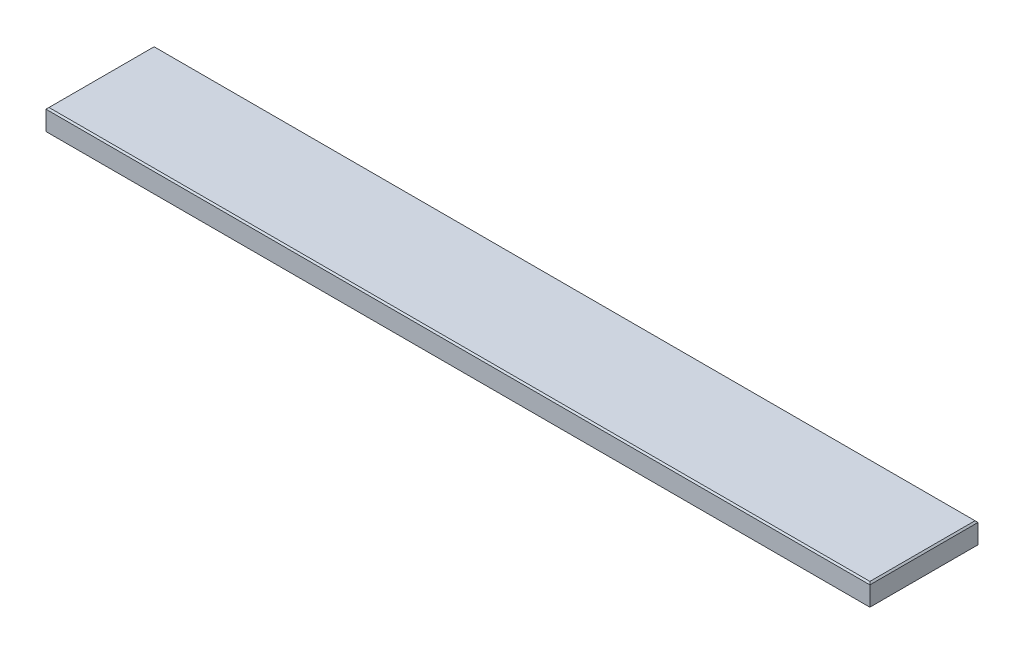
ISO-10303-21;
HEADER;
FILE_DESCRIPTION(('STEP AP214'),'2;1');
FILE_NAME('part.step','',(''),(''),'','','');
FILE_SCHEMA(('AUTOMOTIVE_DESIGN { 1 0 10303 214 1 1 1 1 }'));
ENDSEC;
DATA;
#1=APPLICATION_CONTEXT('core data for automotive mechanical design processes');
#2=APPLICATION_PROTOCOL_DEFINITION('international standard','automotive_design',2000,#1);
#3=PRODUCT_CONTEXT('',#1,'mechanical');
#4=PRODUCT('Part','Part','',(#3));
#5=PRODUCT_RELATED_PRODUCT_CATEGORY('part','',(#4));
#6=PRODUCT_DEFINITION_FORMATION('','',#4);
#7=PRODUCT_DEFINITION_CONTEXT('part definition',#1,'design');
#8=PRODUCT_DEFINITION('design','',#6,#7);
#9=PRODUCT_DEFINITION_SHAPE('','',#8);
#10=(LENGTH_UNIT() NAMED_UNIT(*) SI_UNIT(.MILLI.,.METRE.));
#11=(NAMED_UNIT(*) PLANE_ANGLE_UNIT() SI_UNIT($,.RADIAN.));
#12=(NAMED_UNIT(*) SI_UNIT($,.STERADIAN.) SOLID_ANGLE_UNIT());
#13=UNCERTAINTY_MEASURE_WITH_UNIT(LENGTH_MEASURE(1.E-05),#10,'distance_accuracy_value','');
#14=(GEOMETRIC_REPRESENTATION_CONTEXT(3) GLOBAL_UNCERTAINTY_ASSIGNED_CONTEXT((#13)) GLOBAL_UNIT_ASSIGNED_CONTEXT((#10,
#11,#12)) REPRESENTATION_CONTEXT('',''));
#15=CARTESIAN_POINT('',(0.,0.,0.));
#16=DIRECTION('',(0.,0.,1.));
#17=DIRECTION('',(1.,0.,0.));
#18=AXIS2_PLACEMENT_3D('',#15,#16,#17);
#19=CARTESIAN_POINT('',(1403.35,38.1,0.));
#20=DIRECTION('',(-1.,0.,0.));
#21=DIRECTION('',(0.,0.,1.));
#22=AXIS2_PLACEMENT_3D('',#19,#20,#21);
#23=PLANE('',#22);
#24=DIRECTION('',(0.,-1.,0.));
#25=VECTOR('',#24,1.);
#26=CARTESIAN_POINT('',(1403.35,38.1,-184.15));
#27=LINE('',#26,#25);
#28=CARTESIAN_POINT('',(1403.35,35.56,-184.15));
#29=VERTEX_POINT('',#28);
#30=CARTESIAN_POINT('',(1403.35,2.53999999999978,-184.15));
#31=VERTEX_POINT('',#30);
#32=EDGE_CURVE('E127',#29,#31,#27,.T.);
#33=ORIENTED_EDGE('',*,*,#32,.F.);
#34=DIRECTION('',(0.,0.,1.));
#35=VECTOR('',#34,1.);
#36=CARTESIAN_POINT('',(1403.35,35.56,0.));
#37=LINE('',#36,#35);
#38=CARTESIAN_POINT('',(1403.35,35.56,0.));
#39=VERTEX_POINT('',#38);
#40=EDGE_CURVE('E151',#29,#39,#37,.T.);
#41=ORIENTED_EDGE('',*,*,#40,.T.);
#42=DIRECTION('',(0.,-1.,0.));
#43=VECTOR('',#42,1.);
#44=CARTESIAN_POINT('',(1403.35,38.1,0.));
#45=LINE('',#44,#43);
#46=CARTESIAN_POINT('',(1403.35,2.53999999999978,0.));
#47=VERTEX_POINT('',#46);
#48=EDGE_CURVE('E162',#39,#47,#45,.T.);
#49=ORIENTED_EDGE('',*,*,#48,.T.);
#50=DIRECTION('',(0.,0.,-1.));
#51=VECTOR('',#50,1.);
#52=CARTESIAN_POINT('',(1403.35,2.53999999999976,-184.15));
#53=LINE('',#52,#51);
#54=EDGE_CURVE('E149',#47,#31,#53,.T.);
#55=ORIENTED_EDGE('',*,*,#54,.T.);
#56=EDGE_LOOP('',(#33,#41,#49,#55));
#57=FACE_BOUND('',#56,.T.);
#58=ADVANCED_FACE('F41',(#57),#23,.F.);
#59=CARTESIAN_POINT('',(0.,38.1,-184.15));
#60=DIRECTION('',(0.,0.,1.));
#61=DIRECTION('',(1.,0.,0.));
#62=AXIS2_PLACEMENT_3D('',#59,#60,#61);
#63=PLANE('',#62);
#64=DIRECTION('',(0.,-1.,0.));
#65=VECTOR('',#64,1.);
#66=CARTESIAN_POINT('',(0.,38.1,-184.15));
#67=LINE('',#66,#65);
#68=CARTESIAN_POINT('',(0.,35.56,-184.15));
#69=VERTEX_POINT('',#68);
#70=CARTESIAN_POINT('',(0.,2.53999999999978,-184.15));
#71=VERTEX_POINT('',#70);
#72=EDGE_CURVE('E314',#69,#71,#67,.T.);
#73=ORIENTED_EDGE('',*,*,#72,.F.);
#74=DIRECTION('',(1.,0.,0.));
#75=VECTOR('',#74,1.);
#76=CARTESIAN_POINT('',(0.,35.56,-184.15));
#77=LINE('',#76,#75);
#78=EDGE_CURVE('E147',#69,#29,#77,.T.);
#79=ORIENTED_EDGE('',*,*,#78,.T.);
#80=ORIENTED_EDGE('',*,*,#32,.T.);
#81=DIRECTION('',(-1.,0.,0.));
#82=VECTOR('',#81,1.);
#83=CARTESIAN_POINT('',(0.,2.53999999999976,-184.15));
#84=LINE('',#83,#82);
#85=EDGE_CURVE('E144',#31,#71,#84,.T.);
#86=ORIENTED_EDGE('',*,*,#85,.T.);
#87=EDGE_LOOP('',(#73,#79,#80,#86));
#88=FACE_BOUND('',#87,.T.);
#89=ADVANCED_FACE('F199',(#88),#63,.F.);
#90=CARTESIAN_POINT('',(0.,38.1,0.));
#91=DIRECTION('',(1.,0.,0.));
#92=DIRECTION('',(0.,0.,-1.));
#93=AXIS2_PLACEMENT_3D('',#90,#91,#92);
#94=PLANE('',#93);
#95=DIRECTION('',(0.,-1.,0.));
#96=VECTOR('',#95,1.);
#97=CARTESIAN_POINT('',(0.,38.1,0.));
#98=LINE('',#97,#96);
#99=CARTESIAN_POINT('',(0.,35.56,0.));
#100=VERTEX_POINT('',#99);
#101=CARTESIAN_POINT('',(0.,2.53999999999978,0.));
#102=VERTEX_POINT('',#101);
#103=EDGE_CURVE('E310',#100,#102,#98,.T.);
#104=ORIENTED_EDGE('',*,*,#103,.F.);
#105=DIRECTION('',(0.,0.,-1.));
#106=VECTOR('',#105,1.);
#107=CARTESIAN_POINT('',(0.,35.56,0.));
#108=LINE('',#107,#106);
#109=EDGE_CURVE('E142',#100,#69,#108,.T.);
#110=ORIENTED_EDGE('',*,*,#109,.T.);
#111=ORIENTED_EDGE('',*,*,#72,.T.);
#112=DIRECTION('',(0.,0.,1.));
#113=VECTOR('',#112,1.);
#114=CARTESIAN_POINT('',(0.,2.53999999999976,0.));
#115=LINE('',#114,#113);
#116=EDGE_CURVE('E140',#71,#102,#115,.T.);
#117=ORIENTED_EDGE('',*,*,#116,.T.);
#118=EDGE_LOOP('',(#104,#110,#111,#117));
#119=FACE_BOUND('',#118,.T.);
#120=ADVANCED_FACE('F205',(#119),#94,.F.);
#121=CARTESIAN_POINT('',(0.,38.1,0.));
#122=DIRECTION('',(0.,0.,-1.));
#123=DIRECTION('',(-1.,0.,0.));
#124=AXIS2_PLACEMENT_3D('',#121,#122,#123);
#125=PLANE('',#124);
#126=ORIENTED_EDGE('',*,*,#48,.F.);
#127=DIRECTION('',(-1.,0.,0.));
#128=VECTOR('',#127,1.);
#129=CARTESIAN_POINT('',(0.,35.56,0.));
#130=LINE('',#129,#128);
#131=EDGE_CURVE('E114',#39,#100,#130,.T.);
#132=ORIENTED_EDGE('',*,*,#131,.T.);
#133=ORIENTED_EDGE('',*,*,#103,.T.);
#134=DIRECTION('',(1.,0.,0.));
#135=VECTOR('',#134,1.);
#136=CARTESIAN_POINT('',(1403.35,2.53999999999976,0.));
#137=LINE('',#136,#135);
#138=EDGE_CURVE('E133',#102,#47,#137,.T.);
#139=ORIENTED_EDGE('',*,*,#138,.T.);
#140=EDGE_LOOP('',(#126,#132,#133,#139));
#141=FACE_BOUND('',#140,.T.);
#142=ADVANCED_FACE('F195',(#141),#125,.F.);
#143=CARTESIAN_POINT('',(0.,38.1,0.));
#144=DIRECTION('',(0.,-1.,0.));
#145=DIRECTION('',(0.,0.,-1.));
#146=AXIS2_PLACEMENT_3D('',#143,#144,#145);
#147=PLANE('',#146);
#148=DIRECTION('',(0.,0.,1.));
#149=VECTOR('',#148,1.);
#150=CARTESIAN_POINT('',(2.5400000000002,38.1,0.));
#151=LINE('',#150,#149);
#152=CARTESIAN_POINT('',(2.54000000000021,38.1,-181.61));
#153=VERTEX_POINT('',#152);
#154=CARTESIAN_POINT('',(2.5400000000002,38.1,-2.54000000000021));
#155=VERTEX_POINT('',#154);
#156=EDGE_CURVE('E131',#153,#155,#151,.T.);
#157=ORIENTED_EDGE('',*,*,#156,.T.);
#158=DIRECTION('',(1.,0.,0.));
#159=VECTOR('',#158,1.);
#160=CARTESIAN_POINT('',(0.,38.1,-2.54000000000021));
#161=LINE('',#160,#159);
#162=CARTESIAN_POINT('',(1400.81,38.1,-2.54000000000021));
#163=VERTEX_POINT('',#162);
#164=EDGE_CURVE('E112',#155,#163,#161,.T.);
#165=ORIENTED_EDGE('',*,*,#164,.T.);
#166=DIRECTION('',(0.,0.,-1.));
#167=VECTOR('',#166,1.);
#168=CARTESIAN_POINT('',(1400.81,38.1,0.));
#169=LINE('',#168,#167);
#170=CARTESIAN_POINT('',(1400.81,38.1,-181.61));
#171=VERTEX_POINT('',#170);
#172=EDGE_CURVE('E120',#163,#171,#169,.T.);
#173=ORIENTED_EDGE('',*,*,#172,.T.);
#174=DIRECTION('',(-1.,0.,0.));
#175=VECTOR('',#174,1.);
#176=CARTESIAN_POINT('',(0.,38.1,-181.61));
#177=LINE('',#176,#175);
#178=EDGE_CURVE('E126',#171,#153,#177,.T.);
#179=ORIENTED_EDGE('',*,*,#178,.T.);
#180=EDGE_LOOP('',(#157,#165,#173,#179));
#181=FACE_BOUND('',#180,.T.);
#182=ADVANCED_FACE('F129',(#181),#147,.F.);
#183=CARTESIAN_POINT('',(0.,0.,0.));
#184=DIRECTION('',(0.,-1.,0.));
#185=DIRECTION('',(0.,0.,-1.));
#186=AXIS2_PLACEMENT_3D('',#183,#184,#185);
#187=PLANE('',#186);
#188=DIRECTION('',(0.,0.,-1.));
#189=VECTOR('',#188,1.);
#190=CARTESIAN_POINT('',(2.53999999999976,0.,-184.15));
#191=LINE('',#190,#189);
#192=CARTESIAN_POINT('',(2.53999999999976,0.,-2.53999999999977));
#193=VERTEX_POINT('',#192);
#194=CARTESIAN_POINT('',(2.53999999999976,0.,-181.61));
#195=VERTEX_POINT('',#194);
#196=EDGE_CURVE('E51',#193,#195,#191,.T.);
#197=ORIENTED_EDGE('',*,*,#196,.T.);
#198=DIRECTION('',(1.,0.,0.));
#199=VECTOR('',#198,1.);
#200=CARTESIAN_POINT('',(1403.35,0.,-181.61));
#201=LINE('',#200,#199);
#202=CARTESIAN_POINT('',(1400.81,0.,-181.61));
#203=VERTEX_POINT('',#202);
#204=EDGE_CURVE('E11',#195,#203,#201,.T.);
#205=ORIENTED_EDGE('',*,*,#204,.T.);
#206=DIRECTION('',(0.,0.,1.));
#207=VECTOR('',#206,1.);
#208=CARTESIAN_POINT('',(1400.81,0.,0.));
#209=LINE('',#208,#207);
#210=CARTESIAN_POINT('',(1400.81,0.,-2.53999999999976));
#211=VERTEX_POINT('',#210);
#212=EDGE_CURVE('E153',#203,#211,#209,.T.);
#213=ORIENTED_EDGE('',*,*,#212,.T.);
#214=DIRECTION('',(-1.,0.,0.));
#215=VECTOR('',#214,1.);
#216=CARTESIAN_POINT('',(0.,0.,-2.53999999999977));
#217=LINE('',#216,#215);
#218=EDGE_CURVE('E62',#211,#193,#217,.T.);
#219=ORIENTED_EDGE('',*,*,#218,.T.);
#220=EDGE_LOOP('',(#197,#205,#213,#219));
#221=FACE_BOUND('',#220,.T.);
#222=ADVANCED_FACE('F184',(#221),#187,.T.);
#223=CARTESIAN_POINT('',(0.,38.1,-181.61));
#224=DIRECTION('',(0.,-0.707106781186579,0.707106781186517));
#225=DIRECTION('',(-1.,0.,0.));
#226=AXIS2_PLACEMENT_3D('',#223,#224,#225);
#227=PLANE('',#226);
#228=DIRECTION('',(-0.577350269189643,0.577350269189592,0.577350269189643));
#229=VECTOR('',#228,1.);
#230=CARTESIAN_POINT('',(1340.27333333333,98.6366666666648,-121.07333333333));
#231=LINE('',#230,#229);
#232=EDGE_CURVE('E123',#29,#171,#231,.T.);
#233=ORIENTED_EDGE('',*,*,#232,.F.);
#234=ORIENTED_EDGE('',*,*,#78,.F.);
#235=DIRECTION('',(0.577350269189642,0.577350269189592,0.577350269189643));
#236=VECTOR('',#235,1.);
#237=CARTESIAN_POINT('',(1.69333333333342,37.2533333333333,-182.456666666667));
#238=LINE('',#237,#236);
#239=EDGE_CURVE('E159',#153,#69,#238,.F.);
#240=ORIENTED_EDGE('',*,*,#239,.F.);
#241=ORIENTED_EDGE('',*,*,#178,.F.);
#242=EDGE_LOOP('',(#233,#234,#240,#241));
#243=FACE_BOUND('',#242,.T.);
#244=ADVANCED_FACE('F186',(#243),#227,.F.);
#245=CARTESIAN_POINT('',(2.5400000000002,38.1,0.));
#246=DIRECTION('',(0.707106781186517,-0.707106781186578,0.));
#247=DIRECTION('',(0.,0.,1.));
#248=AXIS2_PLACEMENT_3D('',#245,#246,#247);
#249=PLANE('',#248);
#250=ORIENTED_EDGE('',*,*,#239,.T.);
#251=ORIENTED_EDGE('',*,*,#109,.F.);
#252=DIRECTION('',(0.577350269189642,0.577350269189592,-0.577350269189642));
#253=VECTOR('',#252,1.);
#254=CARTESIAN_POINT('',(1.69333333333342,37.2533333333333,-1.69333333333342));
#255=LINE('',#254,#253);
#256=EDGE_CURVE('E117',#155,#100,#255,.F.);
#257=ORIENTED_EDGE('',*,*,#256,.F.);
#258=ORIENTED_EDGE('',*,*,#156,.F.);
#259=EDGE_LOOP('',(#250,#251,#257,#258));
#260=FACE_BOUND('',#259,.T.);
#261=ADVANCED_FACE('F192',(#260),#249,.F.);
#262=CARTESIAN_POINT('',(1400.81,38.1,0.));
#263=DIRECTION('',(-0.707106781186517,-0.707106781186579,0.));
#264=DIRECTION('',(0.,0.,-1.));
#265=AXIS2_PLACEMENT_3D('',#262,#263,#264);
#266=PLANE('',#265);
#267=ORIENTED_EDGE('',*,*,#232,.T.);
#268=ORIENTED_EDGE('',*,*,#172,.F.);
#269=DIRECTION('',(0.577350269189643,-0.577350269189592,0.577350269189642));
#270=VECTOR('',#269,1.);
#271=CARTESIAN_POINT('',(1401.65666666667,37.2533333333333,-1.69333333333342));
#272=LINE('',#271,#270);
#273=EDGE_CURVE('E108',#39,#163,#272,.F.);
#274=ORIENTED_EDGE('',*,*,#273,.F.);
#275=ORIENTED_EDGE('',*,*,#40,.F.);
#276=EDGE_LOOP('',(#267,#268,#274,#275));
#277=FACE_BOUND('',#276,.T.);
#278=ADVANCED_FACE('F121',(#277),#266,.F.);
#279=CARTESIAN_POINT('',(0.,38.1,-2.54000000000021));
#280=DIRECTION('',(0.,-0.707106781186578,-0.707106781186517));
#281=DIRECTION('',(1.,0.,0.));
#282=AXIS2_PLACEMENT_3D('',#279,#280,#281);
#283=PLANE('',#282);
#284=ORIENTED_EDGE('',*,*,#256,.T.);
#285=ORIENTED_EDGE('',*,*,#131,.F.);
#286=ORIENTED_EDGE('',*,*,#273,.T.);
#287=ORIENTED_EDGE('',*,*,#164,.F.);
#288=EDGE_LOOP('',(#284,#285,#286,#287));
#289=FACE_BOUND('',#288,.T.);
#290=ADVANCED_FACE('F110',(#289),#283,.F.);
#291=CARTESIAN_POINT('',(0.,2.53999999999976,0.));
#292=DIRECTION('',(0.,-0.707106781186547,0.707106781186548));
#293=DIRECTION('',(-1.,0.,0.));
#294=AXIS2_PLACEMENT_3D('',#291,#292,#293);
#295=PLANE('',#294);
#296=DIRECTION('',(0.577350269189626,-0.577350269189626,-0.577350269189626));
#297=VECTOR('',#296,1.);
#298=CARTESIAN_POINT('',(0.,2.53999999999976,0.));
#299=LINE('',#298,#297);
#300=EDGE_CURVE('E166',#193,#102,#299,.F.);
#301=ORIENTED_EDGE('',*,*,#300,.F.);
#302=ORIENTED_EDGE('',*,*,#218,.F.);
#303=DIRECTION('',(-0.577350269189626,-0.577350269189626,-0.577350269189626));
#304=VECTOR('',#303,1.);
#305=CARTESIAN_POINT('',(1403.35,2.53999999999976,0.));
#306=LINE('',#305,#304);
#307=EDGE_CURVE('E46',#47,#211,#306,.T.);
#308=ORIENTED_EDGE('',*,*,#307,.F.);
#309=ORIENTED_EDGE('',*,*,#138,.F.);
#310=EDGE_LOOP('',(#301,#302,#308,#309));
#311=FACE_BOUND('',#310,.T.);
#312=ADVANCED_FACE('F44',(#311),#295,.T.);
#313=CARTESIAN_POINT('',(1403.35,2.53999999999976,0.));
#314=DIRECTION('',(0.707106781186548,-0.707106781186548,0.));
#315=DIRECTION('',(0.,0.,1.));
#316=AXIS2_PLACEMENT_3D('',#313,#314,#315);
#317=PLANE('',#316);
#318=ORIENTED_EDGE('',*,*,#307,.T.);
#319=ORIENTED_EDGE('',*,*,#212,.F.);
#320=DIRECTION('',(0.577350269189626,0.577350269189626,-0.577350269189626));
#321=VECTOR('',#320,1.);
#322=CARTESIAN_POINT('',(1341.96666666667,-58.8433333333336,-122.766666666667));
#323=LINE('',#322,#321);
#324=EDGE_CURVE('E165',#31,#203,#323,.F.);
#325=ORIENTED_EDGE('',*,*,#324,.F.);
#326=ORIENTED_EDGE('',*,*,#54,.F.);
#327=EDGE_LOOP('',(#318,#319,#325,#326));
#328=FACE_BOUND('',#327,.T.);
#329=ADVANCED_FACE('F175',(#328),#317,.T.);
#330=CARTESIAN_POINT('',(0.,2.53999999999976,0.));
#331=DIRECTION('',(-0.707106781186548,-0.707106781186547,0.));
#332=DIRECTION('',(0.,0.,-1.));
#333=AXIS2_PLACEMENT_3D('',#330,#331,#332);
#334=PLANE('',#333);
#335=ORIENTED_EDGE('',*,*,#300,.T.);
#336=ORIENTED_EDGE('',*,*,#116,.F.);
#337=DIRECTION('',(0.577350269189626,-0.577350269189626,0.577350269189626));
#338=VECTOR('',#337,1.);
#339=CARTESIAN_POINT('',(61.3833333333333,-58.8433333333336,-122.766666666667));
#340=LINE('',#339,#338);
#341=EDGE_CURVE('E163',#195,#71,#340,.F.);
#342=ORIENTED_EDGE('',*,*,#341,.F.);
#343=ORIENTED_EDGE('',*,*,#196,.F.);
#344=EDGE_LOOP('',(#335,#336,#342,#343));
#345=FACE_BOUND('',#344,.T.);
#346=ADVANCED_FACE('F180',(#345),#334,.T.);
#347=CARTESIAN_POINT('',(0.,2.53999999999976,-184.15));
#348=DIRECTION('',(0.,-0.707106781186548,-0.707106781186548));
#349=DIRECTION('',(1.,0.,0.));
#350=AXIS2_PLACEMENT_3D('',#347,#348,#349);
#351=PLANE('',#350);
#352=ORIENTED_EDGE('',*,*,#324,.T.);
#353=ORIENTED_EDGE('',*,*,#204,.F.);
#354=ORIENTED_EDGE('',*,*,#341,.T.);
#355=ORIENTED_EDGE('',*,*,#85,.F.);
#356=EDGE_LOOP('',(#352,#353,#354,#355));
#357=FACE_BOUND('',#356,.T.);
#358=ADVANCED_FACE('F183',(#357),#351,.T.);
#359=CLOSED_SHELL('',(#58,#89,#120,#142,#182,#222,#244,#261,#278,#290,#312,#329,#346,#358));
#360=MANIFOLD_SOLID_BREP('B2',#359);
#361=ADVANCED_BREP_SHAPE_REPRESENTATION('',(#18,#360),#14);
#362=SHAPE_DEFINITION_REPRESENTATION(#9,#361);
ENDSEC;
END-ISO-10303-21;
